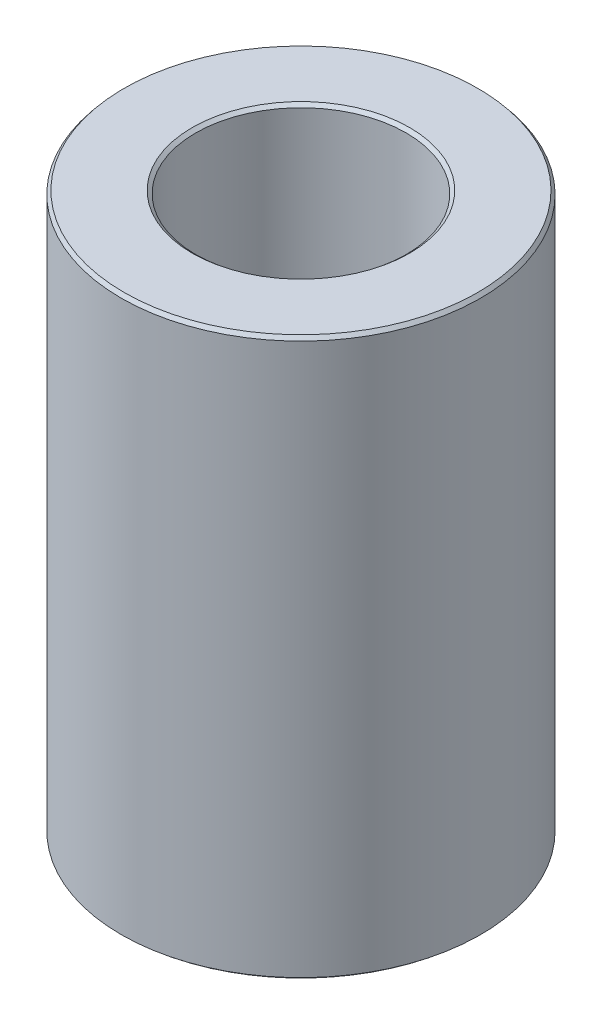
ISO-10303-21;
HEADER;
FILE_DESCRIPTION(('STEP AP214'),'2;1');
FILE_NAME('part.step','',(''),(''),'','','');
FILE_SCHEMA(('AUTOMOTIVE_DESIGN { 1 0 10303 214 1 1 1 1 }'));
ENDSEC;
DATA;
#1=APPLICATION_CONTEXT('core data for automotive mechanical design processes');
#2=APPLICATION_PROTOCOL_DEFINITION('international standard','automotive_design',2000,#1);
#3=PRODUCT_CONTEXT('',#1,'mechanical');
#4=PRODUCT('Part','Part','',(#3));
#5=PRODUCT_RELATED_PRODUCT_CATEGORY('part','',(#4));
#6=PRODUCT_DEFINITION_FORMATION('','',#4);
#7=PRODUCT_DEFINITION_CONTEXT('part definition',#1,'design');
#8=PRODUCT_DEFINITION('design','',#6,#7);
#9=PRODUCT_DEFINITION_SHAPE('','',#8);
#10=(LENGTH_UNIT() NAMED_UNIT(*) SI_UNIT(.MILLI.,.METRE.));
#11=(NAMED_UNIT(*) PLANE_ANGLE_UNIT() SI_UNIT($,.RADIAN.));
#12=(NAMED_UNIT(*) SI_UNIT($,.STERADIAN.) SOLID_ANGLE_UNIT());
#13=UNCERTAINTY_MEASURE_WITH_UNIT(LENGTH_MEASURE(1.E-05),#10,'distance_accuracy_value','');
#14=(GEOMETRIC_REPRESENTATION_CONTEXT(3) GLOBAL_UNCERTAINTY_ASSIGNED_CONTEXT((#13)) GLOBAL_UNIT_ASSIGNED_CONTEXT((#10,
#11,#12)) REPRESENTATION_CONTEXT('',''));
#15=CARTESIAN_POINT('',(0.,0.,0.));
#16=DIRECTION('',(0.,0.,1.));
#17=DIRECTION('',(1.,0.,0.));
#18=AXIS2_PLACEMENT_3D('',#15,#16,#17);
#19=CARTESIAN_POINT('',(0.,178.411777979006,0.));
#20=DIRECTION('',(0.,-1.,0.));
#21=DIRECTION('',(0.,0.,-1.));
#22=AXIS2_PLACEMENT_3D('',#19,#20,#21);
#23=CYLINDRICAL_SURFACE('',#22,57.5);
#24=CARTESIAN_POINT('',(0.,0.921267149861044,0.));
#25=DIRECTION('',(0.,1.,0.));
#26=DIRECTION('',(0.,0.,1.));
#27=AXIS2_PLACEMENT_3D('',#24,#25,#26);
#28=CIRCLE('',#27,57.5);
#29=CARTESIAN_POINT('',(0.,0.921267149861044,57.5));
#30=VERTEX_POINT('',#29);
#31=EDGE_CURVE('E10',#30,#30,#28,.T.);
#32=ORIENTED_EDGE('',*,*,#31,.T.);
#33=EDGE_LOOP('',(#32));
#34=FACE_BOUND('',#33,.T.);
#35=CARTESIAN_POINT('',(0.,177.289358349763,0.));
#36=DIRECTION('',(0.,1.,0.));
#37=DIRECTION('',(0.,0.,1.));
#38=AXIS2_PLACEMENT_3D('',#35,#36,#37);
#39=CIRCLE('',#38,57.5);
#40=CARTESIAN_POINT('',(0.,177.289358349763,57.5));
#41=VERTEX_POINT('',#40);
#42=EDGE_CURVE('E50',#41,#41,#39,.F.);
#43=ORIENTED_EDGE('',*,*,#42,.T.);
#44=EDGE_LOOP('',(#43));
#45=FACE_BOUND('',#44,.T.);
#46=ADVANCED_FACE('F39',(#34,#45),#23,.T.);
#47=CARTESIAN_POINT('',(0.,178.411777979006,0.));
#48=DIRECTION('',(0.,1.,0.));
#49=DIRECTION('',(0.,0.,1.));
#50=AXIS2_PLACEMENT_3D('',#47,#48,#49);
#51=PLANE('',#50);
#52=CARTESIAN_POINT('',(0.,178.411777979006,0.));
#53=DIRECTION('',(0.,1.,0.));
#54=DIRECTION('',(0.,0.,1.));
#55=AXIS2_PLACEMENT_3D('',#52,#53,#54);
#56=CIRCLE('',#55,34.8087200855946);
#57=CARTESIAN_POINT('',(0.,178.411777979006,34.8087200855946));
#58=VERTEX_POINT('',#57);
#59=EDGE_CURVE('E58',#58,#58,#56,.F.);
#60=ORIENTED_EDGE('',*,*,#59,.T.);
#61=EDGE_LOOP('',(#60));
#62=FACE_BOUND('',#61,.T.);
#63=CARTESIAN_POINT('',(0.,178.411777979006,0.));
#64=DIRECTION('',(0.,1.,0.));
#65=DIRECTION('',(0.,0.,1.));
#66=AXIS2_PLACEMENT_3D('',#63,#64,#65);
#67=CIRCLE('',#66,56.578732850139);
#68=CARTESIAN_POINT('',(0.,178.411777979006,56.578732850139));
#69=VERTEX_POINT('',#68);
#70=EDGE_CURVE('E61',#69,#69,#67,.T.);
#71=ORIENTED_EDGE('',*,*,#70,.T.);
#72=EDGE_LOOP('',(#71));
#73=FACE_BOUND('',#72,.T.);
#74=ADVANCED_FACE('F88',(#62,#73),#51,.T.);
#75=CARTESIAN_POINT('',(0.,0.,0.));
#76=DIRECTION('',(0.,1.,0.));
#77=DIRECTION('',(0.,0.,1.));
#78=AXIS2_PLACEMENT_3D('',#75,#76,#77);
#79=PLANE('',#78);
#80=CARTESIAN_POINT('',(0.,0.,0.));
#81=DIRECTION('',(0.,1.,0.));
#82=DIRECTION('',(0.,0.,1.));
#83=AXIS2_PLACEMENT_3D('',#80,#81,#82);
#84=CIRCLE('',#83,34.6075676062125);
#85=CARTESIAN_POINT('',(0.,0.,-34.6075676062125));
#86=VERTEX_POINT('',#85);
#87=EDGE_CURVE('E51',#86,#86,#84,.T.);
#88=ORIENTED_EDGE('',*,*,#87,.T.);
#89=EDGE_LOOP('',(#88));
#90=FACE_BOUND('',#89,.T.);
#91=CARTESIAN_POINT('',(0.,0.,0.));
#92=DIRECTION('',(0.,1.,0.));
#93=DIRECTION('',(0.,0.,1.));
#94=AXIS2_PLACEMENT_3D('',#91,#92,#93);
#95=CIRCLE('',#94,56.3775803707569);
#96=CARTESIAN_POINT('',(0.,0.,56.3775803707569));
#97=VERTEX_POINT('',#96);
#98=EDGE_CURVE('E54',#97,#97,#95,.F.);
#99=ORIENTED_EDGE('',*,*,#98,.T.);
#100=EDGE_LOOP('',(#99));
#101=FACE_BOUND('',#100,.T.);
#102=ADVANCED_FACE('F83',(#90,#101),#79,.F.);
#103=CARTESIAN_POINT('',(0.,178.411777979006,0.));
#104=DIRECTION('',(0.,-1.,0.));
#105=DIRECTION('',(0.,0.,-1.));
#106=AXIS2_PLACEMENT_3D('',#103,#104,#105);
#107=CYLINDRICAL_SURFACE('',#106,33.6863004563515);
#108=CARTESIAN_POINT('',(0.,177.490510829145,0.));
#109=DIRECTION('',(0.,1.,0.));
#110=DIRECTION('',(0.,0.,1.));
#111=AXIS2_PLACEMENT_3D('',#108,#109,#110);
#112=CIRCLE('',#111,33.6863004563515);
#113=CARTESIAN_POINT('',(0.,177.490510829145,33.6863004563515));
#114=VERTEX_POINT('',#113);
#115=EDGE_CURVE('E67',#114,#114,#112,.T.);
#116=ORIENTED_EDGE('',*,*,#115,.T.);
#117=EDGE_LOOP('',(#116));
#118=FACE_BOUND('',#117,.T.);
#119=CARTESIAN_POINT('',(0.,1.12241962924312,0.));
#120=DIRECTION('',(0.,1.,0.));
#121=DIRECTION('',(0.,0.,1.));
#122=AXIS2_PLACEMENT_3D('',#119,#120,#121);
#123=CIRCLE('',#122,33.6863004563515);
#124=CARTESIAN_POINT('',(0.,1.12241962924312,-33.6863004563515));
#125=VERTEX_POINT('',#124);
#126=EDGE_CURVE('E69',#125,#125,#123,.F.);
#127=ORIENTED_EDGE('',*,*,#126,.T.);
#128=EDGE_LOOP('',(#127));
#129=FACE_BOUND('',#128,.T.);
#130=ADVANCED_FACE('F71',(#118,#129),#107,.F.);
#131=CARTESIAN_POINT('',(0.,177.490510829145,0.));
#132=DIRECTION('',(0.,1.,0.));
#133=DIRECTION('',(0.,0.,1.));
#134=AXIS2_PLACEMENT_3D('',#131,#132,#133);
#135=CONICAL_SURFACE('',#134,33.6863004563515,0.883508431953224);
#136=ORIENTED_EDGE('',*,*,#59,.F.);
#137=EDGE_LOOP('',(#136));
#138=FACE_BOUND('',#137,.T.);
#139=ORIENTED_EDGE('',*,*,#115,.F.);
#140=EDGE_LOOP('',(#139));
#141=FACE_BOUND('',#140,.T.);
#142=ADVANCED_FACE('F77',(#138,#141),#135,.F.);
#143=CARTESIAN_POINT('',(0.,0.,0.));
#144=DIRECTION('',(0.,-1.,0.));
#145=DIRECTION('',(0.,0.,-1.));
#146=AXIS2_PLACEMENT_3D('',#143,#144,#145);
#147=CONICAL_SURFACE('',#146,34.6075676062125,0.687287894841646);
#148=CARTESIAN_POINT('',(0.,1.12241962924312,-33.6863004563515));
#149=CARTESIAN_POINT('',(0.,1.11072775810517,-33.6958969891626));
#150=CARTESIAN_POINT('',(0.,1.09903588696722,-33.7054935219737));
#151=CARTESIAN_POINT('',(0.,1.07565214469132,-33.7246865875958));
#152=CARTESIAN_POINT('',(0.,1.06396027355337,-33.7342831204068));
#153=CARTESIAN_POINT('',(0.,1.04057653127747,-33.7534761860289));
#154=CARTESIAN_POINT('',(0.,1.02888466013952,-33.76307271884));
#155=CARTESIAN_POINT('',(0.,1.00550091786362,-33.7822657844621));
#156=CARTESIAN_POINT('',(0.,0.993809046725675,-33.7918623172731));
#157=CARTESIAN_POINT('',(0.,0.970425304449776,-33.8110553828952));
#158=CARTESIAN_POINT('',(0.,0.958733433311827,-33.8206519157063));
#159=CARTESIAN_POINT('',(0.,0.93534969103593,-33.8398449813284));
#160=CARTESIAN_POINT('',(0.,0.923657819897981,-33.8494415141394));
#161=CARTESIAN_POINT('',(0.,0.900274077622082,-33.8686345797615));
#162=CARTESIAN_POINT('',(0.,0.888582206484133,-33.8782311125726));
#163=CARTESIAN_POINT('',(0.,0.865198464208234,-33.8974241781947));
#164=CARTESIAN_POINT('',(0.,0.853506593070285,-33.9070207110057));
#165=CARTESIAN_POINT('',(0.,0.830122850794388,-33.9262137766278));
#166=CARTESIAN_POINT('',(0.,0.818430979656439,-33.9358103094389));
#167=CARTESIAN_POINT('',(0.,0.79504723738054,-33.955003375061));
#168=CARTESIAN_POINT('',(0.,0.783355366242591,-33.964599907872));
#169=CARTESIAN_POINT('',(0.,0.759971623966692,-33.9837929734942));
#170=CARTESIAN_POINT('',(0.,0.748279752828743,-33.9933895063052));
#171=CARTESIAN_POINT('',(0.,0.724896010552846,-34.0125825719273));
#172=CARTESIAN_POINT('',(0.,0.713204139414897,-34.0221791047384));
#173=CARTESIAN_POINT('',(0.,0.689820397138998,-34.0413721703605));
#174=CARTESIAN_POINT('',(0.,0.678128526001048,-34.0509687031715));
#175=CARTESIAN_POINT('',(0.,0.65474478372515,-34.0701617687936));
#176=CARTESIAN_POINT('',(0.,0.643052912587202,-34.0797583016047));
#177=CARTESIAN_POINT('',(0.,0.619669170311304,-34.0989513672268));
#178=CARTESIAN_POINT('',(0.,0.607977299173354,-34.1085479000378));
#179=CARTESIAN_POINT('',(0.,0.584593556897455,-34.1277409656599));
#180=CARTESIAN_POINT('',(0.,0.572901685759506,-34.137337498471));
#181=CARTESIAN_POINT('',(0.,0.549517943483609,-34.1565305640931));
#182=CARTESIAN_POINT('',(0.,0.53782607234566,-34.1661270969041));
#183=CARTESIAN_POINT('',(0.,0.514442330069761,-34.1853201625262));
#184=CARTESIAN_POINT('',(0.,0.502750458931811,-34.1949166953373));
#185=CARTESIAN_POINT('',(0.,0.479366716655913,-34.2141097609594));
#186=CARTESIAN_POINT('',(0.,0.467674845517965,-34.2237062937705));
#187=CARTESIAN_POINT('',(0.,0.444291103242067,-34.2428993593926));
#188=CARTESIAN_POINT('',(0.,0.432599232104117,-34.2524958922036));
#189=CARTESIAN_POINT('',(0.,0.409215489828218,-34.2716889578257));
#190=CARTESIAN_POINT('',(0.,0.39752361869027,-34.2812854906368));
#191=CARTESIAN_POINT('',(0.,0.374139876414372,-34.3004785562589));
#192=CARTESIAN_POINT('',(0.,0.362448005276423,-34.3100750890699));
#193=CARTESIAN_POINT('',(0.,0.339064263000525,-34.329268154692));
#194=CARTESIAN_POINT('',(0.,0.327372391862575,-34.3388646875031));
#195=CARTESIAN_POINT('',(0.,0.303988649586676,-34.3580577531252));
#196=CARTESIAN_POINT('',(0.,0.292296778448728,-34.3676542859362));
#197=CARTESIAN_POINT('',(0.,0.26891303617283,-34.3868473515583));
#198=CARTESIAN_POINT('',(0.,0.257221165034881,-34.3964438843694));
#199=CARTESIAN_POINT('',(0.,0.233837422758983,-34.4156369499915));
#200=CARTESIAN_POINT('',(0.,0.222145551621033,-34.4252334828025));
#201=CARTESIAN_POINT('',(0.,0.198761809345134,-34.4444265484246));
#202=CARTESIAN_POINT('',(0.,0.187069938207185,-34.4540230812357));
#203=CARTESIAN_POINT('',(0.,0.163686195931288,-34.4732161468578));
#204=CARTESIAN_POINT('',(0.,0.151994324793339,-34.4828126796689));
#205=CARTESIAN_POINT('',(0.,0.128610582517441,-34.502005745291));
#206=CARTESIAN_POINT('',(0.,0.116918711379491,-34.511602278102));
#207=CARTESIAN_POINT('',(0.,0.0935349691035924,-34.5307953437241));
#208=CARTESIAN_POINT('',(0.,0.0818430979656442,-34.5403918765352));
#209=CARTESIAN_POINT('',(0.,0.0584593556897463,-34.5595849421573));
#210=CARTESIAN_POINT('',(0.,0.0467674845517965,-34.5691814749683));
#211=CARTESIAN_POINT('',(0.,0.023383742275897,-34.5883745405904));
#212=CARTESIAN_POINT('',(0.,0.0116918711379473,-34.5979710734015));
#213=CARTESIAN_POINT('',(0.,0.,-34.6075676062125));
#214=B_SPLINE_CURVE_WITH_KNOTS('',3,(#148,#149,#150,#151,#152,#153,#154,#155,#156,#157,#158,
#159,#160,#161,#162,#163,#164,#165,#166,#167,#168,#169,#170,#171,#172,#173,#174,#175,#176,#177,
#178,#179,#180,#181,#182,#183,#184,#185,#186,#187,#188,#189,#190,#191,#192,#193,#194,#195,#196,
#197,#198,#199,#200,#201,#202,#203,#204,#205,#206,#207,#208,#209,#210,#211,#212,#213),
.UNSPECIFIED.,.F.,.F.,(4,2,2,2,2,2,2,2,2,2,2,2,2,2,2,2,2,2,2,2,2,2,2,2,2,2,2,2,2,2,2,2,4),(0.,
0.045377743821175,0.0907554876423457,0.136133231463521,0.181510975284691,0.226888719105866,
0.272266462927041,0.317644206748212,0.363021950569387,0.408399694390562,0.453777438211733,
0.499155182032908,0.544532925854083,0.589910669675254,0.635288413496429,0.680666157317599,
0.726043901138774,0.771421644959949,0.81679938878112,0.862177132602295,0.907554876423466,
0.952932620244641,0.998310364065816,1.04368810788699,1.08906585170816,1.13444359552934,
1.17982133935051,1.22519908317168,1.27057682699286,1.31595457081403,1.3613323146352,
1.40671005845637,1.45208780227755),.UNSPECIFIED.);
#215=EDGE_CURVE('BSEAM73',#125,#86,#214,.T.);
#216=ORIENTED_EDGE('',*,*,#126,.F.);
#217=ORIENTED_EDGE('',*,*,#87,.F.);
#218=ORIENTED_EDGE('',*,*,#215,.T.);
#219=ORIENTED_EDGE('',*,*,#215,.F.);
#220=EDGE_LOOP('',(#216,#218,#217,#219));
#221=FACE_BOUND('',#220,.T.);
#222=ADVANCED_FACE('F73',(#221),#147,.F.);
#223=CARTESIAN_POINT('',(0.,0.921267149861044,0.));
#224=DIRECTION('',(0.,1.,0.));
#225=DIRECTION('',(0.,0.,1.));
#226=AXIS2_PLACEMENT_3D('',#223,#224,#225);
#227=CONICAL_SURFACE('',#226,57.5,0.883508431953236);
#228=ORIENTED_EDGE('',*,*,#98,.F.);
#229=EDGE_LOOP('',(#228));
#230=FACE_BOUND('',#229,.T.);
#231=ORIENTED_EDGE('',*,*,#31,.F.);
#232=EDGE_LOOP('',(#231));
#233=FACE_BOUND('',#232,.T.);
#234=ADVANCED_FACE('F76',(#230,#233),#227,.T.);
#235=CARTESIAN_POINT('',(0.,178.411777979006,0.));
#236=DIRECTION('',(0.,-1.,0.));
#237=DIRECTION('',(0.,0.,-1.));
#238=AXIS2_PLACEMENT_3D('',#235,#236,#237);
#239=CONICAL_SURFACE('',#238,56.578732850139,0.687287894841659);
#240=ORIENTED_EDGE('',*,*,#42,.F.);
#241=EDGE_LOOP('',(#240));
#242=FACE_BOUND('',#241,.T.);
#243=ORIENTED_EDGE('',*,*,#70,.F.);
#244=EDGE_LOOP('',(#243));
#245=FACE_BOUND('',#244,.T.);
#246=ADVANCED_FACE('F45',(#242,#245),#239,.T.);
#247=CLOSED_SHELL('',(#46,#74,#102,#130,#142,#222,#234,#246));
#248=MANIFOLD_SOLID_BREP('B2',#247);
#249=ADVANCED_BREP_SHAPE_REPRESENTATION('',(#18,#248),#14);
#250=SHAPE_DEFINITION_REPRESENTATION(#9,#249);
ENDSEC;
END-ISO-10303-21;
